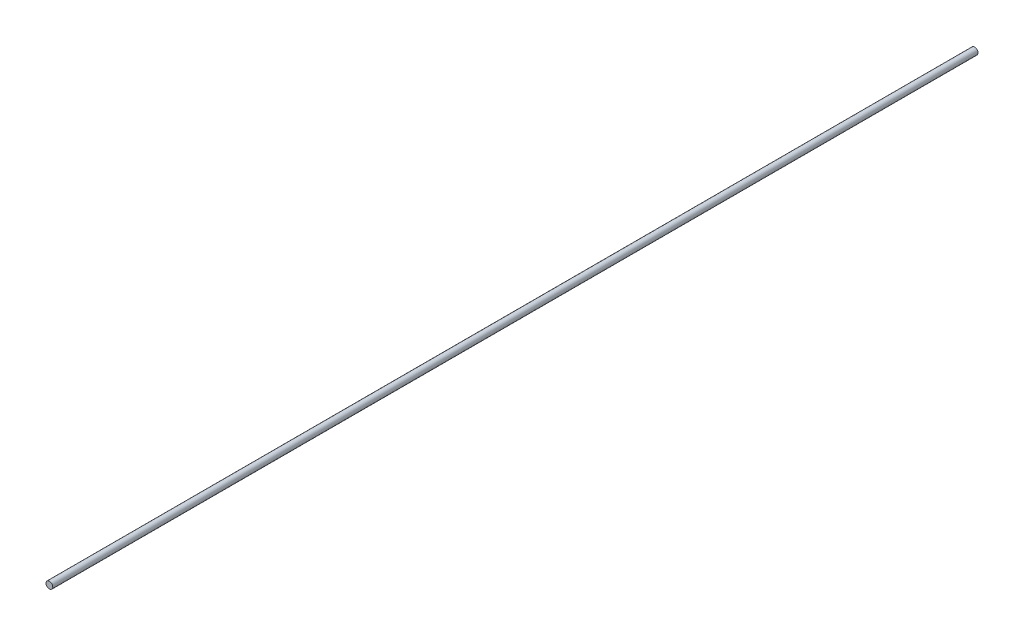
ISO-10303-21;
HEADER;
FILE_DESCRIPTION(('STEP AP214'),'2;1');
FILE_NAME('part.step','',(''),(''),'','','');
FILE_SCHEMA(('AUTOMOTIVE_DESIGN { 1 0 10303 214 1 1 1 1 }'));
ENDSEC;
DATA;
#1=APPLICATION_CONTEXT('core data for automotive mechanical design processes');
#2=APPLICATION_PROTOCOL_DEFINITION('international standard','automotive_design',2000,#1);
#3=PRODUCT_CONTEXT('',#1,'mechanical');
#4=PRODUCT('Part','Part','',(#3));
#5=PRODUCT_RELATED_PRODUCT_CATEGORY('part','',(#4));
#6=PRODUCT_DEFINITION_FORMATION('','',#4);
#7=PRODUCT_DEFINITION_CONTEXT('part definition',#1,'design');
#8=PRODUCT_DEFINITION('design','',#6,#7);
#9=PRODUCT_DEFINITION_SHAPE('','',#8);
#10=(LENGTH_UNIT() NAMED_UNIT(*) SI_UNIT(.MILLI.,.METRE.));
#11=(NAMED_UNIT(*) PLANE_ANGLE_UNIT() SI_UNIT($,.RADIAN.));
#12=(NAMED_UNIT(*) SI_UNIT($,.STERADIAN.) SOLID_ANGLE_UNIT());
#13=UNCERTAINTY_MEASURE_WITH_UNIT(LENGTH_MEASURE(1.E-05),#10,'distance_accuracy_value','');
#14=(GEOMETRIC_REPRESENTATION_CONTEXT(3) GLOBAL_UNCERTAINTY_ASSIGNED_CONTEXT((#13)) GLOBAL_UNIT_ASSIGNED_CONTEXT((#10,
#11,#12)) REPRESENTATION_CONTEXT('',''));
#15=CARTESIAN_POINT('',(0.,0.,0.));
#16=DIRECTION('',(0.,0.,1.));
#17=DIRECTION('',(1.,0.,0.));
#18=AXIS2_PLACEMENT_3D('',#15,#16,#17);
#19=CARTESIAN_POINT('',(0.,0.,410.));
#20=DIRECTION('',(0.,0.,-1.));
#21=DIRECTION('',(-1.,0.,0.));
#22=AXIS2_PLACEMENT_3D('',#19,#20,#21);
#23=CYLINDRICAL_SURFACE('',#22,1.5);
#24=CARTESIAN_POINT('',(0.,0.,410.));
#25=DIRECTION('',(0.,0.,1.));
#26=DIRECTION('',(1.,0.,0.));
#27=AXIS2_PLACEMENT_3D('',#24,#25,#26);
#28=CIRCLE('',#27,1.5);
#29=CARTESIAN_POINT('',(1.5,0.,410.));
#30=VERTEX_POINT('',#29);
#31=EDGE_CURVE('E10',#30,#30,#28,.T.);
#32=ORIENTED_EDGE('',*,*,#31,.F.);
#33=EDGE_LOOP('',(#32));
#34=FACE_BOUND('',#33,.T.);
#35=CARTESIAN_POINT('',(0.,0.,0.));
#36=DIRECTION('',(0.,0.,1.));
#37=DIRECTION('',(1.,0.,0.));
#38=AXIS2_PLACEMENT_3D('',#35,#36,#37);
#39=CIRCLE('',#38,1.5);
#40=CARTESIAN_POINT('',(1.5,0.,0.));
#41=VERTEX_POINT('',#40);
#42=EDGE_CURVE('E40',#41,#41,#39,.T.);
#43=ORIENTED_EDGE('',*,*,#42,.T.);
#44=EDGE_LOOP('',(#43));
#45=FACE_BOUND('',#44,.T.);
#46=ADVANCED_FACE('F37',(#34,#45),#23,.T.);
#47=CARTESIAN_POINT('',(0.,0.,410.));
#48=DIRECTION('',(0.,0.,1.));
#49=DIRECTION('',(1.,0.,0.));
#50=AXIS2_PLACEMENT_3D('',#47,#48,#49);
#51=PLANE('',#50);
#52=ORIENTED_EDGE('',*,*,#31,.T.);
#53=EDGE_LOOP('',(#52));
#54=FACE_BOUND('',#53,.T.);
#55=ADVANCED_FACE('F54',(#54),#51,.T.);
#56=CARTESIAN_POINT('',(0.,0.,0.));
#57=DIRECTION('',(0.,0.,1.));
#58=DIRECTION('',(1.,0.,0.));
#59=AXIS2_PLACEMENT_3D('',#56,#57,#58);
#60=PLANE('',#59);
#61=ORIENTED_EDGE('',*,*,#42,.F.);
#62=EDGE_LOOP('',(#61));
#63=FACE_BOUND('',#62,.T.);
#64=ADVANCED_FACE('F52',(#63),#60,.F.);
#65=CLOSED_SHELL('',(#46,#55,#64));
#66=MANIFOLD_SOLID_BREP('B2',#65);
#67=ADVANCED_BREP_SHAPE_REPRESENTATION('',(#18,#66),#14);
#68=SHAPE_DEFINITION_REPRESENTATION(#9,#67);
ENDSEC;
END-ISO-10303-21;
